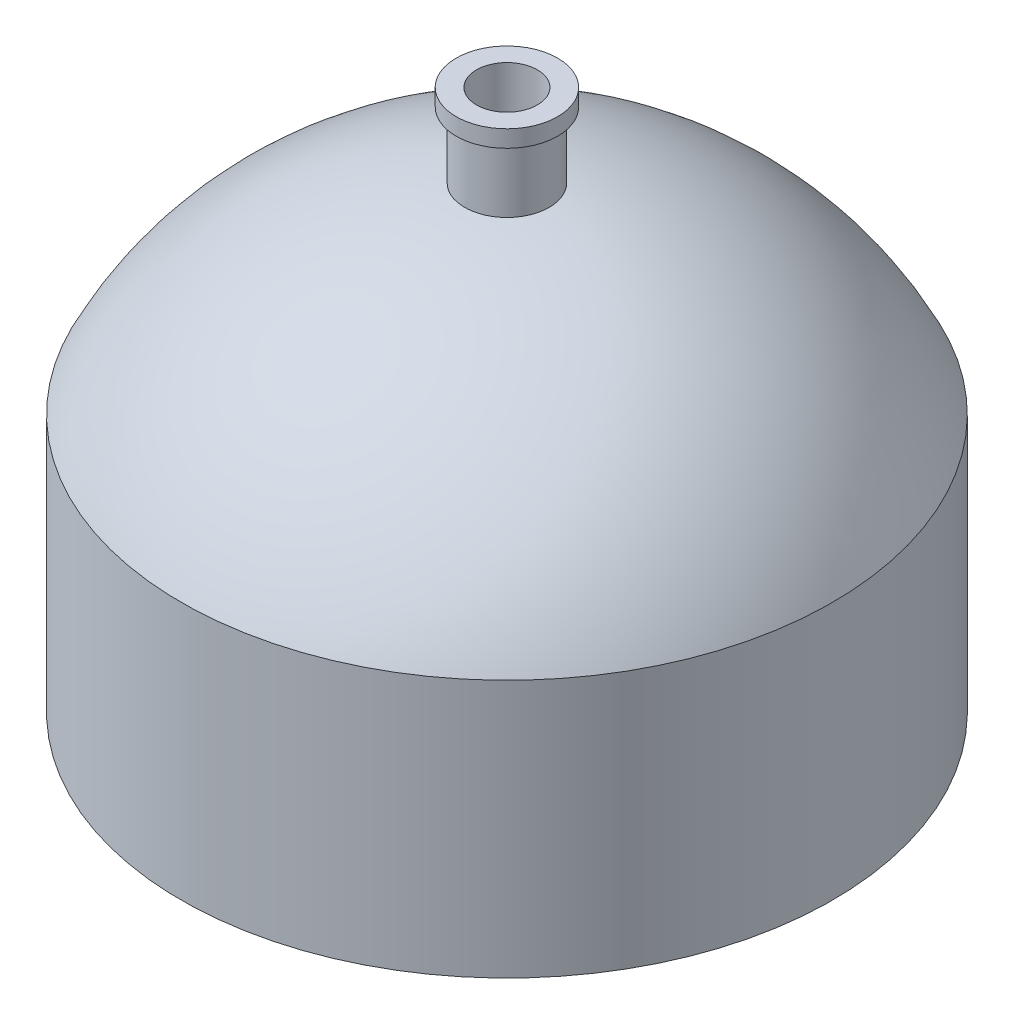
ISO-10303-21;
HEADER;
FILE_DESCRIPTION(('STEP AP214'),'2;1');
FILE_NAME('part.step','',(''),(''),'','','');
FILE_SCHEMA(('AUTOMOTIVE_DESIGN { 1 0 10303 214 1 1 1 1 }'));
ENDSEC;
DATA;
#1=APPLICATION_CONTEXT('core data for automotive mechanical design processes');
#2=APPLICATION_PROTOCOL_DEFINITION('international standard','automotive_design',2000,#1);
#3=PRODUCT_CONTEXT('',#1,'mechanical');
#4=PRODUCT('Part','Part','',(#3));
#5=PRODUCT_RELATED_PRODUCT_CATEGORY('part','',(#4));
#6=PRODUCT_DEFINITION_FORMATION('','',#4);
#7=PRODUCT_DEFINITION_CONTEXT('part definition',#1,'design');
#8=PRODUCT_DEFINITION('design','',#6,#7);
#9=PRODUCT_DEFINITION_SHAPE('','',#8);
#10=(LENGTH_UNIT() NAMED_UNIT(*) SI_UNIT(.MILLI.,.METRE.));
#11=(NAMED_UNIT(*) PLANE_ANGLE_UNIT() SI_UNIT($,.RADIAN.));
#12=(NAMED_UNIT(*) SI_UNIT($,.STERADIAN.) SOLID_ANGLE_UNIT());
#13=UNCERTAINTY_MEASURE_WITH_UNIT(LENGTH_MEASURE(1.E-05),#10,'distance_accuracy_value','');
#14=(GEOMETRIC_REPRESENTATION_CONTEXT(3) GLOBAL_UNCERTAINTY_ASSIGNED_CONTEXT((#13)) GLOBAL_UNIT_ASSIGNED_CONTEXT((#10,
#11,#12)) REPRESENTATION_CONTEXT('',''));
#15=CARTESIAN_POINT('',(0.,0.,0.));
#16=DIRECTION('',(0.,0.,1.));
#17=DIRECTION('',(1.,0.,0.));
#18=AXIS2_PLACEMENT_3D('',#15,#16,#17);
#19=CARTESIAN_POINT('',(0.,5.80989583333333,0.));
#20=DIRECTION('',(0.,0.,1.));
#21=DIRECTION('',(1.,0.,0.));
#22=AXIS2_PLACEMENT_3D('',#19,#20,#21);
#23=SPHERICAL_SURFACE('',#22,21.4401041666667);
#24=CARTESIAN_POINT('',(0.,5.80989583333333,0.));
#25=DIRECTION('',(0.,1.,0.));
#26=DIRECTION('',(0.,0.,1.));
#27=AXIS2_PLACEMENT_3D('',#24,#25,#26);
#28=SPHERICAL_SURFACE('',#27,21.4401041666667);
#29=CARTESIAN_POINT('',(0.,15.25,0.));
#30=DIRECTION('',(0.,1.,0.));
#31=DIRECTION('',(0.,0.,1.));
#32=AXIS2_PLACEMENT_3D('',#29,#30,#31);
#33=CIRCLE('',#32,19.25);
#34=CARTESIAN_POINT('',(0.,15.25,-19.25));
#35=VERTEX_POINT('',#34);
#36=EDGE_CURVE('E77',#35,#35,#33,.T.);
#37=ORIENTED_EDGE('',*,*,#36,.T.);
#38=EDGE_LOOP('',(#37));
#39=FACE_BOUND('',#38,.T.);
#40=CARTESIAN_POINT('',(0.,27.1037462760672,0.));
#41=DIRECTION('',(0.,-1.,0.));
#42=DIRECTION('',(0.,0.,-1.));
#43=AXIS2_PLACEMENT_3D('',#40,#41,#42);
#44=CIRCLE('',#43,2.5);
#45=CARTESIAN_POINT('',(0.,27.1037462760672,-2.5));
#46=VERTEX_POINT('',#45);
#47=EDGE_CURVE('E94',#46,#46,#44,.T.);
#48=ORIENTED_EDGE('',*,*,#47,.T.);
#49=EDGE_LOOP('',(#48));
#50=FACE_BOUND('',#49,.T.);
#51=ADVANCED_FACE('F70',(#39,#50),#28,.T.);
#52=CARTESIAN_POINT('',(0.,5.80989583333333,0.));
#53=DIRECTION('',(0.,0.,1.));
#54=DIRECTION('',(1.,0.,0.));
#55=AXIS2_PLACEMENT_3D('',#52,#53,#54);
#56=SPHERICAL_SURFACE('',#55,20.9401041666667);
#57=CARTESIAN_POINT('',(0.,5.80989583333333,0.));
#58=DIRECTION('',(0.,-1.,0.));
#59=DIRECTION('',(0.,0.,-1.));
#60=AXIS2_PLACEMENT_3D('',#57,#58,#59);
#61=SPHERICAL_SURFACE('',#60,20.9401041666667);
#62=CARTESIAN_POINT('',(0.,15.1332784014172,0.));
#63=DIRECTION('',(0.,-1.,0.));
#64=DIRECTION('',(0.,0.,-1.));
#65=AXIS2_PLACEMENT_3D('',#62,#63,#64);
#66=CIRCLE('',#65,18.75);
#67=CARTESIAN_POINT('',(0.,15.1332784014172,-18.75));
#68=VERTEX_POINT('',#67);
#69=EDGE_CURVE('E87',#68,#68,#66,.F.);
#70=ORIENTED_EDGE('',*,*,#69,.F.);
#71=EDGE_LOOP('',(#70));
#72=FACE_BOUND('',#71,.T.);
#73=CARTESIAN_POINT('',(0.,26.6002292243795,0.));
#74=DIRECTION('',(0.,-1.,0.));
#75=DIRECTION('',(0.,0.,-1.));
#76=AXIS2_PLACEMENT_3D('',#73,#74,#75);
#77=CIRCLE('',#76,2.5);
#78=CARTESIAN_POINT('',(0.,26.6002292243795,-2.5));
#79=VERTEX_POINT('',#78);
#80=EDGE_CURVE('E12',#79,#79,#77,.T.);
#81=ORIENTED_EDGE('',*,*,#80,.F.);
#82=EDGE_LOOP('',(#81));
#83=FACE_BOUND('',#82,.T.);
#84=ADVANCED_FACE('F142',(#72,#83),#61,.F.);
#85=CARTESIAN_POINT('',(0.,15.25,0.));
#86=DIRECTION('',(0.,-1.,0.));
#87=DIRECTION('',(0.,0.,-1.));
#88=AXIS2_PLACEMENT_3D('',#85,#86,#87);
#89=CYLINDRICAL_SURFACE('',#88,19.25);
#90=CARTESIAN_POINT('',(0.,0.,0.));
#91=DIRECTION('',(0.,1.,0.));
#92=DIRECTION('',(0.,0.,1.));
#93=AXIS2_PLACEMENT_3D('',#90,#91,#92);
#94=CIRCLE('',#93,19.25);
#95=CARTESIAN_POINT('',(0.,0.,-19.25));
#96=VERTEX_POINT('',#95);
#97=EDGE_CURVE('E82',#96,#96,#94,.T.);
#98=CARTESIAN_POINT('',(0.,15.25,-19.25));
#99=CARTESIAN_POINT('',(0.,15.0911458333333,-19.25));
#100=CARTESIAN_POINT('',(0.,14.9322916666667,-19.25));
#101=CARTESIAN_POINT('',(0.,14.6145833333333,-19.25));
#102=CARTESIAN_POINT('',(0.,14.4557291666667,-19.25));
#103=CARTESIAN_POINT('',(0.,14.1380208333333,-19.25));
#104=CARTESIAN_POINT('',(0.,13.9791666666667,-19.25));
#105=CARTESIAN_POINT('',(0.,13.6614583333333,-19.25));
#106=CARTESIAN_POINT('',(0.,13.5026041666667,-19.25));
#107=CARTESIAN_POINT('',(0.,13.1848958333333,-19.25));
#108=CARTESIAN_POINT('',(0.,13.0260416666667,-19.25));
#109=CARTESIAN_POINT('',(0.,12.7083333333333,-19.25));
#110=CARTESIAN_POINT('',(0.,12.5494791666667,-19.25));
#111=CARTESIAN_POINT('',(0.,12.2317708333333,-19.25));
#112=CARTESIAN_POINT('',(0.,12.0729166666667,-19.25));
#113=CARTESIAN_POINT('',(0.,11.7552083333333,-19.25));
#114=CARTESIAN_POINT('',(0.,11.5963541666667,-19.25));
#115=CARTESIAN_POINT('',(0.,11.2786458333333,-19.25));
#116=CARTESIAN_POINT('',(0.,11.1197916666667,-19.25));
#117=CARTESIAN_POINT('',(0.,10.8020833333333,-19.25));
#118=CARTESIAN_POINT('',(0.,10.6432291666667,-19.25));
#119=CARTESIAN_POINT('',(0.,10.3255208333333,-19.25));
#120=CARTESIAN_POINT('',(0.,10.1666666666667,-19.25));
#121=CARTESIAN_POINT('',(0.,9.84895833333333,-19.25));
#122=CARTESIAN_POINT('',(0.,9.69010416666666,-19.25));
#123=CARTESIAN_POINT('',(0.,9.37239583333333,-19.25));
#124=CARTESIAN_POINT('',(0.,9.21354166666666,-19.25));
#125=CARTESIAN_POINT('',(0.,8.89583333333333,-19.25));
#126=CARTESIAN_POINT('',(0.,8.73697916666667,-19.25));
#127=CARTESIAN_POINT('',(0.,8.41927083333333,-19.25));
#128=CARTESIAN_POINT('',(0.,8.26041666666667,-19.25));
#129=CARTESIAN_POINT('',(0.,7.94270833333333,-19.25));
#130=CARTESIAN_POINT('',(0.,7.78385416666667,-19.25));
#131=CARTESIAN_POINT('',(0.,7.46614583333333,-19.25));
#132=CARTESIAN_POINT('',(0.,7.30729166666667,-19.25));
#133=CARTESIAN_POINT('',(0.,6.98958333333333,-19.25));
#134=CARTESIAN_POINT('',(0.,6.83072916666667,-19.25));
#135=CARTESIAN_POINT('',(0.,6.51302083333333,-19.25));
#136=CARTESIAN_POINT('',(0.,6.35416666666667,-19.25));
#137=CARTESIAN_POINT('',(0.,6.03645833333333,-19.25));
#138=CARTESIAN_POINT('',(0.,5.87760416666667,-19.25));
#139=CARTESIAN_POINT('',(0.,5.55989583333333,-19.25));
#140=CARTESIAN_POINT('',(0.,5.40104166666667,-19.25));
#141=CARTESIAN_POINT('',(0.,5.08333333333333,-19.25));
#142=CARTESIAN_POINT('',(0.,4.92447916666667,-19.25));
#143=CARTESIAN_POINT('',(0.,4.60677083333333,-19.25));
#144=CARTESIAN_POINT('',(0.,4.44791666666667,-19.25));
#145=CARTESIAN_POINT('',(0.,4.13020833333333,-19.25));
#146=CARTESIAN_POINT('',(0.,3.97135416666667,-19.25));
#147=CARTESIAN_POINT('',(0.,3.65364583333333,-19.25));
#148=CARTESIAN_POINT('',(0.,3.49479166666667,-19.25));
#149=CARTESIAN_POINT('',(0.,3.17708333333333,-19.25));
#150=CARTESIAN_POINT('',(0.,3.01822916666667,-19.25));
#151=CARTESIAN_POINT('',(0.,2.70052083333333,-19.25));
#152=CARTESIAN_POINT('',(0.,2.54166666666667,-19.25));
#153=CARTESIAN_POINT('',(0.,2.22395833333333,-19.25));
#154=CARTESIAN_POINT('',(0.,2.06510416666667,-19.25));
#155=CARTESIAN_POINT('',(0.,1.74739583333333,-19.25));
#156=CARTESIAN_POINT('',(0.,1.58854166666667,-19.25));
#157=CARTESIAN_POINT('',(0.,1.27083333333333,-19.25));
#158=CARTESIAN_POINT('',(0.,1.11197916666667,-19.25));
#159=CARTESIAN_POINT('',(0.,0.794270833333332,-19.25));
#160=CARTESIAN_POINT('',(0.,0.635416666666665,-19.25));
#161=CARTESIAN_POINT('',(0.,0.317708333333331,-19.25));
#162=CARTESIAN_POINT('',(0.,0.158854166666665,-19.25));
#163=CARTESIAN_POINT('',(0.,0.,-19.25));
#164=B_SPLINE_CURVE_WITH_KNOTS('',3,(#98,#99,#100,#101,#102,#103,#104,#105,#106,#107,#108,#109,
#110,#111,#112,#113,#114,#115,#116,#117,#118,#119,#120,#121,#122,#123,#124,#125,#126,#127,#128,
#129,#130,#131,#132,#133,#134,#135,#136,#137,#138,#139,#140,#141,#142,#143,#144,#145,#146,#147,
#148,#149,#150,#151,#152,#153,#154,#155,#156,#157,#158,#159,#160,#161,#162,#163),.UNSPECIFIED.,
.F.,.F.,(4,2,2,2,2,2,2,2,2,2,2,2,2,2,2,2,2,2,2,2,2,2,2,2,2,2,2,2,2,2,2,2,4),(0.,
0.476562500000001,0.953125000000001,1.4296875,1.90625,2.3828125,2.859375,3.3359375,3.8125,
4.2890625,4.765625,5.2421875,5.71875,6.1953125,6.671875,7.1484375,7.625,8.1015625,8.578125,
9.0546875,9.53125,10.0078125,10.484375,10.9609375,11.4375,11.9140625,12.390625,12.8671875,
13.34375,13.8203125,14.296875,14.7734375,15.25),.UNSPECIFIED.);
#165=EDGE_CURVE('BSEAM146',#35,#96,#164,.T.);
#166=ORIENTED_EDGE('',*,*,#36,.F.);
#167=ORIENTED_EDGE('',*,*,#97,.T.);
#168=ORIENTED_EDGE('',*,*,#165,.T.);
#169=ORIENTED_EDGE('',*,*,#165,.F.);
#170=EDGE_LOOP('',(#166,#168,#167,#169));
#171=FACE_BOUND('',#170,.T.);
#172=ADVANCED_FACE('F146',(#171),#89,.T.);
#173=CARTESIAN_POINT('',(0.,0.,0.));
#174=DIRECTION('',(0.,1.,0.));
#175=DIRECTION('',(0.,0.,1.));
#176=AXIS2_PLACEMENT_3D('',#173,#174,#175);
#177=PLANE('',#176);
#178=CARTESIAN_POINT('',(0.,0.,0.));
#179=DIRECTION('',(0.,1.,0.));
#180=DIRECTION('',(0.,0.,1.));
#181=AXIS2_PLACEMENT_3D('',#178,#179,#180);
#182=CIRCLE('',#181,18.75);
#183=CARTESIAN_POINT('',(0.,0.,-18.75));
#184=VERTEX_POINT('',#183);
#185=EDGE_CURVE('E90',#184,#184,#182,.T.);
#186=ORIENTED_EDGE('',*,*,#185,.T.);
#187=EDGE_LOOP('',(#186));
#188=FACE_BOUND('',#187,.T.);
#189=ORIENTED_EDGE('',*,*,#97,.F.);
#190=EDGE_LOOP('',(#189));
#191=FACE_BOUND('',#190,.T.);
#192=ADVANCED_FACE('F167',(#188,#191),#177,.F.);
#193=CARTESIAN_POINT('',(0.,15.25,0.));
#194=DIRECTION('',(0.,-1.,0.));
#195=DIRECTION('',(0.,0.,-1.));
#196=AXIS2_PLACEMENT_3D('',#193,#194,#195);
#197=CYLINDRICAL_SURFACE('',#196,18.75);
#198=CARTESIAN_POINT('',(0.,15.1332784014172,-18.75));
#199=CARTESIAN_POINT('',(0.,14.9756400847358,-18.75));
#200=CARTESIAN_POINT('',(0.,14.8180017680544,-18.75));
#201=CARTESIAN_POINT('',(0.,14.5027251346915,-18.75));
#202=CARTESIAN_POINT('',(0.,14.3450868180101,-18.75));
#203=CARTESIAN_POINT('',(0.,14.0298101846472,-18.75));
#204=CARTESIAN_POINT('',(0.,13.8721718679658,-18.75));
#205=CARTESIAN_POINT('',(0.,13.5568952346029,-18.75));
#206=CARTESIAN_POINT('',(0.,13.3992569179215,-18.75));
#207=CARTESIAN_POINT('',(0.,13.0839802845587,-18.75));
#208=CARTESIAN_POINT('',(0.,12.9263419678772,-18.75));
#209=CARTESIAN_POINT('',(0.,12.6110653345144,-18.75));
#210=CARTESIAN_POINT('',(0.,12.4534270178329,-18.75));
#211=CARTESIAN_POINT('',(0.,12.1381503844701,-18.75));
#212=CARTESIAN_POINT('',(0.,11.9805120677886,-18.75));
#213=CARTESIAN_POINT('',(0.,11.6652354344258,-18.75));
#214=CARTESIAN_POINT('',(0.,11.5075971177444,-18.75));
#215=CARTESIAN_POINT('',(0.,11.1923204843815,-18.75));
#216=CARTESIAN_POINT('',(0.,11.0346821677001,-18.75));
#217=CARTESIAN_POINT('',(0.,10.7194055343372,-18.75));
#218=CARTESIAN_POINT('',(0.,10.5617672176558,-18.75));
#219=CARTESIAN_POINT('',(0.,10.2464905842929,-18.75));
#220=CARTESIAN_POINT('',(0.,10.0888522676115,-18.75));
#221=CARTESIAN_POINT('',(0.,9.77357563424863,-18.75));
#222=CARTESIAN_POINT('',(0.,9.6159373175672,-18.75));
#223=CARTESIAN_POINT('',(0.,9.30066068420434,-18.75));
#224=CARTESIAN_POINT('',(0.,9.14302236752291,-18.75));
#225=CARTESIAN_POINT('',(0.,8.82774573416005,-18.75));
#226=CARTESIAN_POINT('',(0.,8.67010741747862,-18.75));
#227=CARTESIAN_POINT('',(0.,8.35483078411577,-18.75));
#228=CARTESIAN_POINT('',(0.,8.19719246743433,-18.75));
#229=CARTESIAN_POINT('',(0.,7.88191583407148,-18.75));
#230=CARTESIAN_POINT('',(0.,7.72427751739005,-18.75));
#231=CARTESIAN_POINT('',(0.,7.40900088402719,-18.75));
#232=CARTESIAN_POINT('',(0.,7.25136256734576,-18.75));
#233=CARTESIAN_POINT('',(0.,6.9360859339829,-18.75));
#234=CARTESIAN_POINT('',(0.,6.77844761730147,-18.75));
#235=CARTESIAN_POINT('',(0.,6.46317098393861,-18.75));
#236=CARTESIAN_POINT('',(0.,6.30553266725718,-18.75));
#237=CARTESIAN_POINT('',(0.,5.99025603389432,-18.75));
#238=CARTESIAN_POINT('',(0.,5.83261771721289,-18.75));
#239=CARTESIAN_POINT('',(0.,5.51734108385003,-18.75));
#240=CARTESIAN_POINT('',(0.,5.3597027671686,-18.75));
#241=CARTESIAN_POINT('',(0.,5.04442613380574,-18.75));
#242=CARTESIAN_POINT('',(0.,4.88678781712432,-18.75));
#243=CARTESIAN_POINT('',(0.,4.57151118376146,-18.75));
#244=CARTESIAN_POINT('',(0.,4.41387286708003,-18.75));
#245=CARTESIAN_POINT('',(0.,4.09859623371717,-18.75));
#246=CARTESIAN_POINT('',(0.,3.94095791703574,-18.75));
#247=CARTESIAN_POINT('',(0.,3.62568128367288,-18.75));
#248=CARTESIAN_POINT('',(0.,3.46804296699145,-18.75));
#249=CARTESIAN_POINT('',(0.,3.15276633362859,-18.75));
#250=CARTESIAN_POINT('',(0.,2.99512801694716,-18.75));
#251=CARTESIAN_POINT('',(0.,2.6798513835843,-18.75));
#252=CARTESIAN_POINT('',(0.,2.52221306690287,-18.75));
#253=CARTESIAN_POINT('',(0.,2.20693643354001,-18.75));
#254=CARTESIAN_POINT('',(0.,2.04929811685858,-18.75));
#255=CARTESIAN_POINT('',(0.,1.73402148349572,-18.75));
#256=CARTESIAN_POINT('',(0.,1.57638316681429,-18.75));
#257=CARTESIAN_POINT('',(0.,1.26110653345143,-18.75));
#258=CARTESIAN_POINT('',(0.,1.10346821677001,-18.75));
#259=CARTESIAN_POINT('',(0.,0.788191583407146,-18.75));
#260=CARTESIAN_POINT('',(0.,0.630553266725717,-18.75));
#261=CARTESIAN_POINT('',(0.,0.315276633362858,-18.75));
#262=CARTESIAN_POINT('',(0.,0.157638316681428,-18.75));
#263=CARTESIAN_POINT('',(0.,0.,-18.75));
#264=B_SPLINE_CURVE_WITH_KNOTS('',3,(#198,#199,#200,#201,#202,#203,#204,#205,#206,#207,#208,
#209,#210,#211,#212,#213,#214,#215,#216,#217,#218,#219,#220,#221,#222,#223,#224,#225,#226,#227,
#228,#229,#230,#231,#232,#233,#234,#235,#236,#237,#238,#239,#240,#241,#242,#243,#244,#245,#246,
#247,#248,#249,#250,#251,#252,#253,#254,#255,#256,#257,#258,#259,#260,#261,#262,#263),
.UNSPECIFIED.,.F.,.F.,(4,2,2,2,2,2,2,2,2,2,2,2,2,2,2,2,2,2,2,2,2,2,2,2,2,2,2,2,2,2,2,2,4),(0.,
0.472914950044288,0.945829900088577,1.41874485013286,1.89165980017715,2.36457475022144,
2.83748970026573,3.31040465031002,3.78331960035431,4.2562345503986,4.72914950044288,
5.20206445048717,5.67497940053146,6.14789435057575,6.62080930062004,7.09372425066433,
7.56663920070862,8.03955415075291,8.5124691007972,8.98538405084148,9.45829900088577,
9.93121395093006,10.4041289009743,10.8770438510186,11.3499588010629,11.8228737511072,
12.2957887011515,12.7687036511958,13.2416186012401,13.7145335512844,14.1874485013287,
14.6603634513729,15.1332784014172),.UNSPECIFIED.);
#265=EDGE_CURVE('BSEAM165',#68,#184,#264,.T.);
#266=ORIENTED_EDGE('',*,*,#69,.T.);
#267=ORIENTED_EDGE('',*,*,#185,.F.);
#268=ORIENTED_EDGE('',*,*,#265,.T.);
#269=ORIENTED_EDGE('',*,*,#265,.F.);
#270=EDGE_LOOP('',(#266,#268,#267,#269));
#271=FACE_BOUND('',#270,.T.);
#272=ADVANCED_FACE('F165',(#271),#197,.F.);
#273=CARTESIAN_POINT('',(0.,0.,0.));
#274=DIRECTION('',(0.,1.,0.));
#275=DIRECTION('',(0.,0.,1.));
#276=AXIS2_PLACEMENT_3D('',#273,#274,#275);
#277=PLANE('',#276);
#278=CARTESIAN_POINT('',(0.,0.,0.));
#279=DIRECTION('',(0.,1.,0.));
#280=DIRECTION('',(0.,0.,1.));
#281=AXIS2_PLACEMENT_3D('',#278,#279,#280);
#282=CIRCLE('',#281,1.8);
#283=CARTESIAN_POINT('',(0.,0.,1.8));
#284=VERTEX_POINT('',#283);
#285=EDGE_CURVE('E105',#284,#284,#282,.T.);
#286=ORIENTED_EDGE('',*,*,#285,.T.);
#287=EDGE_LOOP('',(#286));
#288=FACE_BOUND('',#287,.T.);
#289=CARTESIAN_POINT('',(0.,0.,0.));
#290=DIRECTION('',(0.,1.,0.));
#291=DIRECTION('',(0.,0.,1.));
#292=AXIS2_PLACEMENT_3D('',#289,#290,#291);
#293=CIRCLE('',#292,2.5);
#294=CARTESIAN_POINT('',(0.,0.,2.5));
#295=VERTEX_POINT('',#294);
#296=EDGE_CURVE('E101',#295,#295,#293,.T.);
#297=ORIENTED_EDGE('',*,*,#296,.F.);
#298=EDGE_LOOP('',(#297));
#299=FACE_BOUND('',#298,.T.);
#300=ADVANCED_FACE('F161',(#288,#299),#277,.F.);
#301=CARTESIAN_POINT('',(0.,32.,0.));
#302=DIRECTION('',(0.,-1.,0.));
#303=DIRECTION('',(0.,0.,-1.));
#304=AXIS2_PLACEMENT_3D('',#301,#302,#303);
#305=CYLINDRICAL_SURFACE('',#304,2.5);
#306=ORIENTED_EDGE('',*,*,#296,.T.);
#307=EDGE_LOOP('',(#306));
#308=FACE_BOUND('',#307,.T.);
#309=ORIENTED_EDGE('',*,*,#80,.T.);
#310=EDGE_LOOP('',(#309));
#311=FACE_BOUND('',#310,.T.);
#312=ADVANCED_FACE('F153',(#308,#311),#305,.T.);
#313=CARTESIAN_POINT('',(0.,31.,0.));
#314=DIRECTION('',(0.,-1.,0.));
#315=DIRECTION('',(0.,0.,-1.));
#316=AXIS2_PLACEMENT_3D('',#313,#314,#315);
#317=CIRCLE('',#316,2.5);
#318=CARTESIAN_POINT('',(0.,31.,-2.5));
#319=VERTEX_POINT('',#318);
#320=EDGE_CURVE('E118',#319,#319,#317,.T.);
#321=ORIENTED_EDGE('',*,*,#320,.T.);
#322=EDGE_LOOP('',(#321));
#323=FACE_BOUND('',#322,.T.);
#324=ORIENTED_EDGE('',*,*,#47,.F.);
#325=EDGE_LOOP('',(#324));
#326=FACE_BOUND('',#325,.T.);
#327=ADVANCED_FACE('F126',(#323,#326),#305,.T.);
#328=CARTESIAN_POINT('',(0.,32.,0.));
#329=DIRECTION('',(0.,1.,0.));
#330=DIRECTION('',(0.,0.,1.));
#331=AXIS2_PLACEMENT_3D('',#328,#329,#330);
#332=PLANE('',#331);
#333=CARTESIAN_POINT('',(0.,32.,0.));
#334=DIRECTION('',(0.,1.,0.));
#335=DIRECTION('',(0.,0.,1.));
#336=AXIS2_PLACEMENT_3D('',#333,#334,#335);
#337=CIRCLE('',#336,1.8);
#338=CARTESIAN_POINT('',(0.,32.,1.8));
#339=VERTEX_POINT('',#338);
#340=EDGE_CURVE('E106',#339,#339,#337,.T.);
#341=ORIENTED_EDGE('',*,*,#340,.F.);
#342=EDGE_LOOP('',(#341));
#343=FACE_BOUND('',#342,.T.);
#344=CARTESIAN_POINT('',(0.,32.,0.));
#345=DIRECTION('',(0.,1.,0.));
#346=DIRECTION('',(0.,0.,-1.));
#347=AXIS2_PLACEMENT_3D('',#344,#345,#346);
#348=CIRCLE('',#347,3.);
#349=CARTESIAN_POINT('',(0.,32.,-3.));
#350=VERTEX_POINT('',#349);
#351=EDGE_CURVE('E114',#350,#350,#348,.T.);
#352=ORIENTED_EDGE('',*,*,#351,.T.);
#353=EDGE_LOOP('',(#352));
#354=FACE_BOUND('',#353,.T.);
#355=ADVANCED_FACE('F152',(#343,#354),#332,.T.);
#356=CARTESIAN_POINT('',(0.,0.,0.));
#357=DIRECTION('',(0.,1.,0.));
#358=DIRECTION('',(0.,0.,1.));
#359=AXIS2_PLACEMENT_3D('',#356,#357,#358);
#360=CYLINDRICAL_SURFACE('',#359,1.8);
#361=ORIENTED_EDGE('',*,*,#285,.F.);
#362=EDGE_LOOP('',(#361));
#363=FACE_BOUND('',#362,.T.);
#364=ORIENTED_EDGE('',*,*,#340,.T.);
#365=EDGE_LOOP('',(#364));
#366=FACE_BOUND('',#365,.T.);
#367=ADVANCED_FACE('F137',(#363,#366),#360,.F.);
#368=CARTESIAN_POINT('',(0.,31.,0.));
#369=DIRECTION('',(0.,1.,0.));
#370=DIRECTION('',(0.,0.,1.));
#371=AXIS2_PLACEMENT_3D('',#368,#369,#370);
#372=CYLINDRICAL_SURFACE('',#371,3.);
#373=ORIENTED_EDGE('',*,*,#351,.F.);
#374=EDGE_LOOP('',(#373));
#375=FACE_BOUND('',#374,.T.);
#376=CARTESIAN_POINT('',(0.,31.,0.));
#377=DIRECTION('',(0.,1.,0.));
#378=DIRECTION('',(0.,0.,-1.));
#379=AXIS2_PLACEMENT_3D('',#376,#377,#378);
#380=CIRCLE('',#379,3.);
#381=CARTESIAN_POINT('',(0.,31.,-3.));
#382=VERTEX_POINT('',#381);
#383=EDGE_CURVE('E110',#382,#382,#380,.T.);
#384=ORIENTED_EDGE('',*,*,#383,.T.);
#385=EDGE_LOOP('',(#384));
#386=FACE_BOUND('',#385,.T.);
#387=ADVANCED_FACE('F131',(#375,#386),#372,.T.);
#388=CARTESIAN_POINT('',(0.,31.,0.));
#389=DIRECTION('',(0.,-1.,0.));
#390=DIRECTION('',(0.,0.,-1.));
#391=AXIS2_PLACEMENT_3D('',#388,#389,#390);
#392=PLANE('',#391);
#393=ORIENTED_EDGE('',*,*,#383,.F.);
#394=EDGE_LOOP('',(#393));
#395=FACE_BOUND('',#394,.T.);
#396=ORIENTED_EDGE('',*,*,#320,.F.);
#397=EDGE_LOOP('',(#396));
#398=FACE_BOUND('',#397,.T.);
#399=ADVANCED_FACE('F129',(#395,#398),#392,.T.);
#400=CLOSED_SHELL('',(#51,#84,#172,#192,#272,#300,#312,#327,#355,#367,#387,#399));
#401=MANIFOLD_SOLID_BREP('B2',#400);
#402=ADVANCED_BREP_SHAPE_REPRESENTATION('',(#18,#401),#14);
#403=SHAPE_DEFINITION_REPRESENTATION(#9,#402);
ENDSEC;
END-ISO-10303-21;
